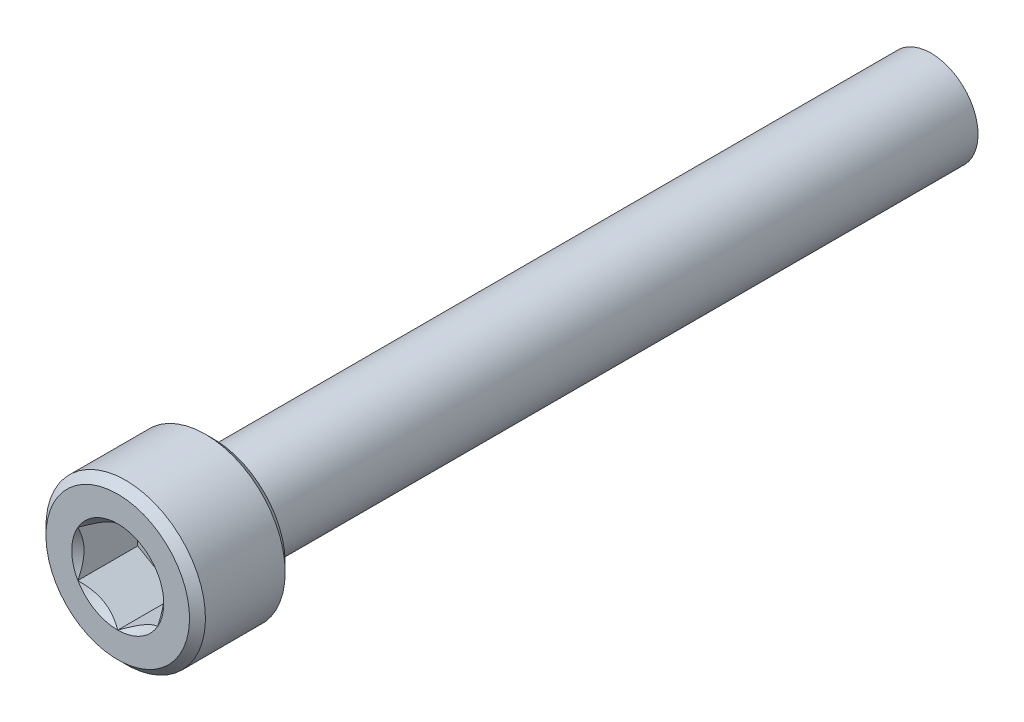
ISO-10303-21;
HEADER;
FILE_DESCRIPTION(('STEP AP214'),'2;1');
FILE_NAME('part.step','',(''),(''),'','','');
FILE_SCHEMA(('AUTOMOTIVE_DESIGN { 1 0 10303 214 1 1 1 1 }'));
ENDSEC;
DATA;
#1=APPLICATION_CONTEXT('core data for automotive mechanical design processes');
#2=APPLICATION_PROTOCOL_DEFINITION('international standard','automotive_design',2000,#1);
#3=PRODUCT_CONTEXT('',#1,'mechanical');
#4=PRODUCT('Part','Part','',(#3));
#5=PRODUCT_RELATED_PRODUCT_CATEGORY('part','',(#4));
#6=PRODUCT_DEFINITION_FORMATION('','',#4);
#7=PRODUCT_DEFINITION_CONTEXT('part definition',#1,'design');
#8=PRODUCT_DEFINITION('design','',#6,#7);
#9=PRODUCT_DEFINITION_SHAPE('','',#8);
#10=(LENGTH_UNIT() NAMED_UNIT(*) SI_UNIT(.MILLI.,.METRE.));
#11=(NAMED_UNIT(*) PLANE_ANGLE_UNIT() SI_UNIT($,.RADIAN.));
#12=(NAMED_UNIT(*) SI_UNIT($,.STERADIAN.) SOLID_ANGLE_UNIT());
#13=UNCERTAINTY_MEASURE_WITH_UNIT(LENGTH_MEASURE(1.E-05),#10,'distance_accuracy_value','');
#14=(GEOMETRIC_REPRESENTATION_CONTEXT(3) GLOBAL_UNCERTAINTY_ASSIGNED_CONTEXT((#13)) GLOBAL_UNIT_ASSIGNED_CONTEXT((#10,
#11,#12)) REPRESENTATION_CONTEXT('',''));
#15=CARTESIAN_POINT('',(0.,0.,0.));
#16=DIRECTION('',(0.,0.,1.));
#17=DIRECTION('',(1.,0.,0.));
#18=AXIS2_PLACEMENT_3D('',#15,#16,#17);
#19=CARTESIAN_POINT('',(2.5,-4.33012701892219,2.25));
#20=DIRECTION('',(0.,0.,1.));
#21=DIRECTION('',(0.,-1.,0.));
#22=AXIS2_PLACEMENT_3D('',#19,#20,#21);
#23=PLANE('',#22);
#24=DIRECTION('',(-0.866025403784439,-0.5,0.));
#25=VECTOR('',#24,1.);
#26=CARTESIAN_POINT('',(0.,2.88675134594813,2.25));
#27=LINE('',#26,#25);
#28=CARTESIAN_POINT('',(0.,2.88675134594813,2.25));
#29=VERTEX_POINT('',#28);
#30=CARTESIAN_POINT('',(-2.5,1.44337567297407,2.25));
#31=VERTEX_POINT('',#30);
#32=EDGE_CURVE('E82',#29,#31,#27,.T.);
#33=ORIENTED_EDGE('',*,*,#32,.T.);
#34=DIRECTION('',(0.,-1.,0.));
#35=VECTOR('',#34,1.);
#36=CARTESIAN_POINT('',(-2.5,1.44337567297407,2.25));
#37=LINE('',#36,#35);
#38=CARTESIAN_POINT('',(-2.5,-1.44337567297406,2.25));
#39=VERTEX_POINT('',#38);
#40=EDGE_CURVE('E84',#31,#39,#37,.T.);
#41=ORIENTED_EDGE('',*,*,#40,.T.);
#42=DIRECTION('',(0.866025403784439,-0.5,0.));
#43=VECTOR('',#42,1.);
#44=CARTESIAN_POINT('',(-2.5,-1.44337567297406,2.25));
#45=LINE('',#44,#43);
#46=CARTESIAN_POINT('',(0.,-2.88675134594813,2.25));
#47=VERTEX_POINT('',#46);
#48=EDGE_CURVE('E85',#39,#47,#45,.T.);
#49=ORIENTED_EDGE('',*,*,#48,.T.);
#50=DIRECTION('',(0.866025403784439,0.5,0.));
#51=VECTOR('',#50,1.);
#52=CARTESIAN_POINT('',(0.,-2.88675134594813,2.25));
#53=LINE('',#52,#51);
#54=CARTESIAN_POINT('',(2.5,-1.44337567297406,2.25));
#55=VERTEX_POINT('',#54);
#56=EDGE_CURVE('E71',#47,#55,#53,.T.);
#57=ORIENTED_EDGE('',*,*,#56,.T.);
#58=DIRECTION('',(0.,1.,0.));
#59=VECTOR('',#58,1.);
#60=CARTESIAN_POINT('',(2.5,-1.44337567297406,2.25));
#61=LINE('',#60,#59);
#62=CARTESIAN_POINT('',(2.5,1.44337567297407,2.25));
#63=VERTEX_POINT('',#62);
#64=EDGE_CURVE('E110',#55,#63,#61,.T.);
#65=ORIENTED_EDGE('',*,*,#64,.T.);
#66=DIRECTION('',(-0.866025403784439,0.5,0.));
#67=VECTOR('',#66,1.);
#68=CARTESIAN_POINT('',(2.5,1.44337567297407,2.25));
#69=LINE('',#68,#67);
#70=EDGE_CURVE('E115',#63,#29,#69,.T.);
#71=ORIENTED_EDGE('',*,*,#70,.T.);
#72=EDGE_LOOP('',(#33,#41,#49,#57,#65,#71));
#73=FACE_BOUND('',#72,.T.);
#74=ADVANCED_FACE('F16',(#73),#23,.T.);
#75=CARTESIAN_POINT('',(-2.5,-1.44337567297406,2.25));
#76=DIRECTION('',(-0.5,-0.866025403784439,0.));
#77=DIRECTION('',(0.866025403784439,-0.5,0.));
#78=AXIS2_PLACEMENT_3D('',#75,#76,#77);
#79=PLANE('',#78);
#80=CARTESIAN_POINT('',(-2.50000000000478,-1.44337567296488,5.99999999997284));
#81=CARTESIAN_POINT('',(-2.41407377906344,-1.49298519975992,5.95043808245741));
#82=CARTESIAN_POINT('',(-2.32671086994276,-1.54342419885962,5.90378750042485));
#83=CARTESIAN_POINT('',(-2.14856893286567,-1.64627449418629,5.8183722762495));
#84=CARTESIAN_POINT('',(-2.05777297285882,-1.69869556613711,5.77965514357985));
#85=CARTESIAN_POINT('',(-1.87468737313266,-1.80440008642343,5.71333243481046));
#86=CARTESIAN_POINT('',(-1.78244433466394,-1.85765662951433,5.68556020407587));
#87=CARTESIAN_POINT('',(-1.59592809138011,-1.96534183278258,5.64277179301007));
#88=CARTESIAN_POINT('',(-1.50166058027178,-2.01976720569677,5.62772368472119));
#89=CARTESIAN_POINT('',(-1.33918618210886,-2.11357184321254,5.61414605045882));
#90=CARTESIAN_POINT('',(-1.27118904996239,-2.15283000576143,5.61213672815934));
#91=CARTESIAN_POINT('',(-1.13530603995205,-2.2312820981692,5.61552620020698));
#92=CARTESIAN_POINT('',(-1.06742020943239,-2.27047600069389,5.620927591165));
#93=CARTESIAN_POINT('',(-0.932289663227805,-2.34849365792084,5.63883111085846));
#94=CARTESIAN_POINT('',(-0.865045749955355,-2.38731694935006,5.65134117856481));
#95=CARTESIAN_POINT('',(-0.731720772442206,-2.46429216100698,5.68277536815797));
#96=CARTESIAN_POINT('',(-0.66563961942911,-2.50244413248745,5.70169899813869));
#97=CARTESIAN_POINT('',(-0.496416901917538,-2.60014491399575,5.75786430114282));
#98=CARTESIAN_POINT('',(-0.394323538956246,-2.65908854458393,5.79933497180169));
#99=CARTESIAN_POINT('',(-0.244203096422894,-2.74576062249143,5.86934112808069));
#100=CARTESIAN_POINT('',(-0.194731548971638,-2.77432303372964,5.89393775594674));
#101=CARTESIAN_POINT('',(-0.0967044691439402,-2.83091899465603,5.94537285125215));
#102=CARTESIAN_POINT('',(-0.0481483974394195,-2.85895285572543,5.9722099447588));
#103=CARTESIAN_POINT('',(8.22878246257458E-12,-2.88675134595287,5.99999999997017));
#104=B_SPLINE_CURVE_WITH_KNOTS('',3,(#80,#81,#82,#83,#84,#85,#86,#87,#88,#89,#90,#91,#92,#93,
#94,#95,#96,#97,#98,#99,#100,#101,#102,#103),.UNSPECIFIED.,.F.,.F.,(4,2,2,2,2,2,2,2,2,2,2,4),
(0.,0.332957366453414,0.667853853669039,0.997433317041697,1.32618330926339,1.56147590696143,
1.79685096897262,2.0324894159688,2.26810979410381,2.6422318258904,2.82878537250701,
3.01522534660843),.UNSPECIFIED.);
#105=CARTESIAN_POINT('',(-2.50000000000431,-1.44337567297655,5.9999999999704));
#106=VERTEX_POINT('',#105);
#107=CARTESIAN_POINT('',(-1.2122602004148E-12,-2.8867513459538,5.9999999999711));
#108=VERTEX_POINT('',#107);
#109=EDGE_CURVE('E19',#106,#108,#104,.T.);
#110=ORIENTED_EDGE('',*,*,#109,.T.);
#111=DIRECTION('',(0.,0.,1.));
#112=VECTOR('',#111,1.);
#113=CARTESIAN_POINT('',(0.,-2.88675134594813,2.25));
#114=LINE('',#113,#112);
#115=EDGE_CURVE('E90',#108,#47,#114,.F.);
#116=ORIENTED_EDGE('',*,*,#115,.T.);
#117=ORIENTED_EDGE('',*,*,#48,.F.);
#118=DIRECTION('',(0.,0.,1.));
#119=VECTOR('',#118,1.);
#120=CARTESIAN_POINT('',(-2.5,-1.44337567297406,2.25));
#121=LINE('',#120,#119);
#122=EDGE_CURVE('E58',#39,#106,#121,.T.);
#123=ORIENTED_EDGE('',*,*,#122,.T.);
#124=EDGE_LOOP('',(#110,#116,#117,#123));
#125=FACE_BOUND('',#124,.T.);
#126=ADVANCED_FACE('F89',(#125),#79,.F.);
#127=CARTESIAN_POINT('',(-2.5,1.44337567297407,2.25));
#128=DIRECTION('',(-1.,0.,0.));
#129=DIRECTION('',(0.,-1.,0.));
#130=AXIS2_PLACEMENT_3D('',#127,#128,#129);
#131=PLANE('',#130);
#132=CARTESIAN_POINT('',(-2.49999999999444,1.4433756729828,5.99999999997284));
#133=CARTESIAN_POINT('',(-2.499999999998,1.3441566194114,5.95043808245644));
#134=CARTESIAN_POINT('',(-2.49999999999946,1.24327862122713,5.90378750042239));
#135=CARTESIAN_POINT('',(-2.50000000000054,1.03757803060085,5.81837227624268));
#136=CARTESIAN_POINT('',(-2.50000000000014,0.932735886711096,5.77965514357014));
#137=CARTESIAN_POINT('',(-2.49999999999986,0.721326846162478,5.7133324347933));
#138=CARTESIAN_POINT('',(-2.49999999999996,0.614813759992766,5.68556020405418));
#139=CARTESIAN_POINT('',(-2.50000000000004,0.399443353479625,5.64277179297774));
#140=CARTESIAN_POINT('',(-2.50000000000001,0.290592607662495,5.62772368468276));
#141=CARTESIAN_POINT('',(-2.49999999999999,0.10298333265714,5.61414605040953));
#142=CARTESIAN_POINT('',(-2.5,0.0244670075745337,5.61213672810486));
#143=CARTESIAN_POINT('',(-2.5,-0.132437177211233,5.61552620014042));
#144=CARTESIAN_POINT('',(-2.5,-0.210824982246007,5.62092759109157));
#145=CARTESIAN_POINT('',(-2.5,-0.366860296671375,5.63883111077006));
#146=CARTESIAN_POINT('',(-2.5,-0.444506879515861,5.65134117846832));
#147=CARTESIAN_POINT('',(-2.5,-0.598457302802447,5.68277536804459));
#148=CARTESIAN_POINT('',(-2.5,-0.67476124575008,5.7016989980165));
#149=CARTESIAN_POINT('',(-2.5,-0.87016280881075,5.75786430101982));
#150=CARTESIAN_POINT('',(-2.5,-0.988050070042253,5.79933497169557));
#151=CARTESIAN_POINT('',(-2.5,-1.16139422593618,5.86934112800866));
#152=CARTESIAN_POINT('',(-2.5,-1.21851904843836,5.89393775588756));
#153=CARTESIAN_POINT('',(-2.5,-1.3317109703414,5.94537285122098));
#154=CARTESIAN_POINT('',(-2.5,-1.38777869250468,5.97220994474277));
#155=CARTESIAN_POINT('',(-2.5,-1.44337567298356,5.99999999997017));
#156=B_SPLINE_CURVE_WITH_KNOTS('',3,(#132,#133,#134,#135,#136,#137,#138,#139,#140,#141,#142,
#143,#144,#145,#146,#147,#148,#149,#150,#151,#152,#153,#154,#155),.UNSPECIFIED.,.F.,.F.,(4,2,2,
2,2,2,2,2,2,2,2,4),(0.,0.332957366421071,0.667853853604345,0.997433316945952,1.32618330913662,
1.56147590678967,1.79685096875581,2.03248941570688,2.26810979379679,2.64223182575469,
2.8287853724575,3.01522534664473),.UNSPECIFIED.);
#157=CARTESIAN_POINT('',(-2.50000000000431,1.44337567297656,5.9999999999704));
#158=VERTEX_POINT('',#157);
#159=EDGE_CURVE('E94',#158,#106,#156,.T.);
#160=ORIENTED_EDGE('',*,*,#159,.T.);
#161=ORIENTED_EDGE('',*,*,#122,.F.);
#162=ORIENTED_EDGE('',*,*,#40,.F.);
#163=DIRECTION('',(0.,0.,1.));
#164=VECTOR('',#163,1.);
#165=CARTESIAN_POINT('',(-2.5,1.44337567297407,2.25));
#166=LINE('',#165,#164);
#167=EDGE_CURVE('E96',#31,#158,#166,.T.);
#168=ORIENTED_EDGE('',*,*,#167,.T.);
#169=EDGE_LOOP('',(#160,#161,#162,#168));
#170=FACE_BOUND('',#169,.T.);
#171=ADVANCED_FACE('F92',(#170),#131,.F.);
#172=CARTESIAN_POINT('',(0.,2.88675134594813,2.25));
#173=DIRECTION('',(-0.5,0.866025403784439,0.));
#174=DIRECTION('',(-0.866025403784439,-0.5,0.));
#175=AXIS2_PLACEMENT_3D('',#172,#173,#174);
#176=PLANE('',#175);
#177=CARTESIAN_POINT('',(1.03437304235675E-11,2.88675134594768,5.99999999997284));
#178=CARTESIAN_POINT('',(-0.0859262209345602,2.8371418191588,5.95043808245742));
#179=CARTESIAN_POINT('',(-0.173289130056698,2.78670282006164,5.90378750042485));
#180=CARTESIAN_POINT('',(-0.351431067134871,2.68385252473684,5.81837227624951));
#181=CARTESIAN_POINT('',(-0.442227027141324,2.63143145278532,5.77965514357985));
#182=CARTESIAN_POINT('',(-0.6253126268672,2.52572693249852,5.71333243481047));
#183=CARTESIAN_POINT('',(-0.717555665336021,2.47247038940779,5.68556020407588));
#184=CARTESIAN_POINT('',(-0.904071908619929,2.36478518613968,5.64277179301007));
#185=CARTESIAN_POINT('',(-0.998339419728224,2.31035981322544,5.6277236847212));
#186=CARTESIAN_POINT('',(-1.16081381789113,2.21655517570964,5.61414605045883));
#187=CARTESIAN_POINT('',(-1.22881095003761,2.17729701316076,5.61213672815934));
#188=CARTESIAN_POINT('',(-1.36469396004795,2.09884492075299,5.61552620020698));
#189=CARTESIAN_POINT('',(-1.43257979056761,2.0596510182283,5.620927591165));
#190=CARTESIAN_POINT('',(-1.56771033677219,1.98163336100134,5.63883111085846));
#191=CARTESIAN_POINT('',(-1.63495425004464,1.94281006957213,5.65134117856481));
#192=CARTESIAN_POINT('',(-1.76827922755779,1.86583485791521,5.68277536815798));
#193=CARTESIAN_POINT('',(-1.83436038057089,1.82768288643474,5.7016989981387));
#194=CARTESIAN_POINT('',(-2.00358309808246,1.72998210492644,5.75786430114282));
#195=CARTESIAN_POINT('',(-2.10567646104375,1.67103847433826,5.79933497180169));
#196=CARTESIAN_POINT('',(-2.2557969035771,1.58436639643077,5.8693411280807));
#197=CARTESIAN_POINT('',(-2.30526845102836,1.55580398519256,5.89393775594674));
#198=CARTESIAN_POINT('',(-2.40329553085606,1.49920802426616,5.94537285125216));
#199=CARTESIAN_POINT('',(-2.45185160256058,1.47117416319677,5.9722099447588));
#200=CARTESIAN_POINT('',(-2.50000000000822,1.44337567296932,5.99999999997017));
#201=B_SPLINE_CURVE_WITH_KNOTS('',3,(#177,#178,#179,#180,#181,#182,#183,#184,#185,#186,#187,
#188,#189,#190,#191,#192,#193,#194,#195,#196,#197,#198,#199,#200),.UNSPECIFIED.,.F.,.F.,(4,2,2,
2,2,2,2,2,2,2,2,4),(0.,0.332957366453413,0.667853853669037,0.997433317041695,1.32618330926339,
1.56147590696143,1.79685096897261,2.0324894159688,2.26810979410381,2.6422318258904,
2.828785372507,3.01522534660842),.UNSPECIFIED.);
#202=CARTESIAN_POINT('',(0.,2.88675134595311,5.9999999999704));
#203=VERTEX_POINT('',#202);
#204=EDGE_CURVE('E197',#203,#158,#201,.T.);
#205=ORIENTED_EDGE('',*,*,#204,.T.);
#206=ORIENTED_EDGE('',*,*,#167,.F.);
#207=ORIENTED_EDGE('',*,*,#32,.F.);
#208=DIRECTION('',(0.,0.,1.));
#209=VECTOR('',#208,1.);
#210=CARTESIAN_POINT('',(0.,2.88675134594813,2.25));
#211=LINE('',#210,#209);
#212=EDGE_CURVE('E112',#29,#203,#211,.T.);
#213=ORIENTED_EDGE('',*,*,#212,.T.);
#214=EDGE_LOOP('',(#205,#206,#207,#213));
#215=FACE_BOUND('',#214,.T.);
#216=ADVANCED_FACE('F207',(#215),#176,.F.);
#217=CARTESIAN_POINT('',(2.5,1.44337567297407,2.25));
#218=DIRECTION('',(0.5,0.866025403784439,0.));
#219=DIRECTION('',(-0.866025403784439,0.5,0.));
#220=AXIS2_PLACEMENT_3D('',#217,#218,#219);
#221=PLANE('',#220);
#222=CARTESIAN_POINT('',(2.50000000000478,1.44337567296489,5.99999999997284));
#223=CARTESIAN_POINT('',(2.41407377906344,1.49298519975993,5.95043808245742));
#224=CARTESIAN_POINT('',(2.32671086994276,1.54342419885963,5.90378750042486));
#225=CARTESIAN_POINT('',(2.14856893286567,1.6462744941863,5.81837227624951));
#226=CARTESIAN_POINT('',(2.05777297285882,1.69869556613712,5.77965514357985));
#227=CARTESIAN_POINT('',(1.87468737313266,1.80440008642344,5.71333243481047));
#228=CARTESIAN_POINT('',(1.78244433466394,1.85765662951434,5.68556020407588));
#229=CARTESIAN_POINT('',(1.59592809138011,1.96534183278259,5.64277179301007));
#230=CARTESIAN_POINT('',(1.50166058027179,2.01976720569678,5.6277236847212));
#231=CARTESIAN_POINT('',(1.33918618210886,2.11357184321255,5.61414605045883));
#232=CARTESIAN_POINT('',(1.2711890499624,2.15283000576144,5.61213672815935));
#233=CARTESIAN_POINT('',(1.13530603995205,2.23128209816921,5.61552620020699));
#234=CARTESIAN_POINT('',(1.06742020943239,2.2704760006939,5.62092759116501));
#235=CARTESIAN_POINT('',(0.932289663227807,2.34849365792085,5.63883111085847));
#236=CARTESIAN_POINT('',(0.865045749955358,2.38731694935007,5.65134117856482));
#237=CARTESIAN_POINT('',(0.731720772442207,2.46429216100699,5.68277536815798));
#238=CARTESIAN_POINT('',(0.665639619429111,2.50244413248746,5.7016989981387));
#239=CARTESIAN_POINT('',(0.49641690191754,2.60014491399576,5.75786430114283));
#240=CARTESIAN_POINT('',(0.394323538956249,2.65908854458394,5.7993349718017));
#241=CARTESIAN_POINT('',(0.244203096422899,2.74576062249143,5.8693411280807));
#242=CARTESIAN_POINT('',(0.194731548971643,2.77432303372964,5.89393775594674));
#243=CARTESIAN_POINT('',(0.0967044691439463,2.83091899465604,5.94537285125216));
#244=CARTESIAN_POINT('',(0.048148397439426,2.85895285572543,5.9722099447588));
#245=CARTESIAN_POINT('',(-8.22208739684531E-12,2.88675134595288,5.99999999997018));
#246=B_SPLINE_CURVE_WITH_KNOTS('',3,(#222,#223,#224,#225,#226,#227,#228,#229,#230,#231,#232,
#233,#234,#235,#236,#237,#238,#239,#240,#241,#242,#243,#244,#245),.UNSPECIFIED.,.F.,.F.,(4,2,2,
2,2,2,2,2,2,2,2,4),(0.,0.332957366453411,0.667853853669034,0.997433317041691,1.32618330926338,
1.56147590696142,1.79685096897261,2.03248941596879,2.26810979410381,2.64223182589039,
2.828785372507,3.01522534660841),.UNSPECIFIED.);
#247=CARTESIAN_POINT('',(2.50000000000431,1.44337567297656,5.9999999999704));
#248=VERTEX_POINT('',#247);
#249=EDGE_CURVE('E189',#248,#203,#246,.T.);
#250=ORIENTED_EDGE('',*,*,#249,.T.);
#251=ORIENTED_EDGE('',*,*,#212,.F.);
#252=ORIENTED_EDGE('',*,*,#70,.F.);
#253=DIRECTION('',(0.,0.,-1.));
#254=VECTOR('',#253,1.);
#255=CARTESIAN_POINT('',(2.5,1.44337567297407,2.25));
#256=LINE('',#255,#254);
#257=EDGE_CURVE('E107',#63,#248,#256,.F.);
#258=ORIENTED_EDGE('',*,*,#257,.T.);
#259=EDGE_LOOP('',(#250,#251,#252,#258));
#260=FACE_BOUND('',#259,.T.);
#261=ADVANCED_FACE('F203',(#260),#221,.F.);
#262=CARTESIAN_POINT('',(2.5,-1.44337567297406,2.25));
#263=DIRECTION('',(1.,0.,0.));
#264=DIRECTION('',(0.,0.,-1.));
#265=AXIS2_PLACEMENT_3D('',#262,#263,#264);
#266=PLANE('',#265);
#267=CARTESIAN_POINT('',(2.49999999999444,-1.44337567298279,5.99999999997284));
#268=CARTESIAN_POINT('',(2.499999999998,-1.3441566194114,5.95043808245644));
#269=CARTESIAN_POINT('',(2.49999999999946,-1.24327862122713,5.90378750042239));
#270=CARTESIAN_POINT('',(2.50000000000054,-1.03757803060085,5.81837227624268));
#271=CARTESIAN_POINT('',(2.50000000000014,-0.932735886711091,5.77965514357014));
#272=CARTESIAN_POINT('',(2.49999999999986,-0.721326846162473,5.7133324347933));
#273=CARTESIAN_POINT('',(2.49999999999996,-0.614813759992762,5.68556020405418));
#274=CARTESIAN_POINT('',(2.50000000000004,-0.399443353479622,5.64277179297774));
#275=CARTESIAN_POINT('',(2.50000000000001,-0.290592607662492,5.62772368468276));
#276=CARTESIAN_POINT('',(2.49999999999999,-0.102983332657137,5.61414605040954));
#277=CARTESIAN_POINT('',(2.5,-0.0244670075745308,5.61213672810486));
#278=CARTESIAN_POINT('',(2.5,0.132437177211236,5.61552620014043));
#279=CARTESIAN_POINT('',(2.5,0.21082498224601,5.62092759109157));
#280=CARTESIAN_POINT('',(2.5,0.366860296671379,5.63883111077006));
#281=CARTESIAN_POINT('',(2.5,0.444506879515865,5.65134117846832));
#282=CARTESIAN_POINT('',(2.5,0.598457302802451,5.68277536804459));
#283=CARTESIAN_POINT('',(2.5,0.674761245750083,5.7016989980165));
#284=CARTESIAN_POINT('',(2.5,0.870162808810754,5.75786430101983));
#285=CARTESIAN_POINT('',(2.5,0.988050070042257,5.79933497169558));
#286=CARTESIAN_POINT('',(2.5,1.16139422593619,5.86934112800866));
#287=CARTESIAN_POINT('',(2.5,1.21851904843837,5.89393775588756));
#288=CARTESIAN_POINT('',(2.5,1.33171097034141,5.94537285122098));
#289=CARTESIAN_POINT('',(2.5,1.38777869250468,5.97220994474277));
#290=CARTESIAN_POINT('',(2.5,1.44337567298357,5.99999999997018));
#291=B_SPLINE_CURVE_WITH_KNOTS('',3,(#267,#268,#269,#270,#271,#272,#273,#274,#275,#276,#277,
#278,#279,#280,#281,#282,#283,#284,#285,#286,#287,#288,#289,#290),.UNSPECIFIED.,.F.,.F.,(4,2,2,
2,2,2,2,2,2,2,2,4),(0.,0.33295736642107,0.667853853604343,0.997433316945949,1.32618330913661,
1.56147590678967,1.79685096875581,2.03248941570687,2.26810979379679,2.64223182575469,
2.8287853724575,3.01522534664473),.UNSPECIFIED.);
#292=CARTESIAN_POINT('',(2.50000000000431,-1.44337567297655,5.9999999999704));
#293=VERTEX_POINT('',#292);
#294=EDGE_CURVE('E159',#293,#248,#291,.T.);
#295=ORIENTED_EDGE('',*,*,#294,.T.);
#296=ORIENTED_EDGE('',*,*,#257,.F.);
#297=ORIENTED_EDGE('',*,*,#64,.F.);
#298=DIRECTION('',(0.,0.,1.));
#299=VECTOR('',#298,1.);
#300=CARTESIAN_POINT('',(2.5,-1.44337567297406,2.25));
#301=LINE('',#300,#299);
#302=EDGE_CURVE('E39',#55,#293,#301,.T.);
#303=ORIENTED_EDGE('',*,*,#302,.T.);
#304=EDGE_LOOP('',(#295,#296,#297,#303));
#305=FACE_BOUND('',#304,.T.);
#306=ADVANCED_FACE('F206',(#305),#266,.F.);
#307=CARTESIAN_POINT('',(0.,-2.88675134594813,2.25));
#308=DIRECTION('',(0.5,-0.866025403784439,0.));
#309=DIRECTION('',(0.866025403784439,0.5,0.));
#310=AXIS2_PLACEMENT_3D('',#307,#308,#309);
#311=PLANE('',#310);
#312=CARTESIAN_POINT('',(-1.03421625670786E-11,-2.88675134594768,5.99999999997284));
#313=CARTESIAN_POINT('',(0.0859262209345617,-2.8371418191588,5.95043808245742));
#314=CARTESIAN_POINT('',(0.1732891300567,-2.78670282006164,5.90378750042485));
#315=CARTESIAN_POINT('',(0.351431067134872,-2.68385252473684,5.81837227624951));
#316=CARTESIAN_POINT('',(0.442227027141325,-2.63143145278532,5.77965514357985));
#317=CARTESIAN_POINT('',(0.625312626867201,-2.52572693249852,5.71333243481047));
#318=CARTESIAN_POINT('',(0.717555665336022,-2.47247038940779,5.68556020407588));
#319=CARTESIAN_POINT('',(0.904071908619929,-2.36478518613968,5.64277179301007));
#320=CARTESIAN_POINT('',(0.998339419728224,-2.31035981322543,5.6277236847212));
#321=CARTESIAN_POINT('',(1.16081381789113,-2.21655517570964,5.61414605045883));
#322=CARTESIAN_POINT('',(1.2288109500376,-2.17729701316076,5.61213672815935));
#323=CARTESIAN_POINT('',(1.36469396004795,-2.09884492075299,5.61552620020698));
#324=CARTESIAN_POINT('',(1.43257979056761,-2.0596510182283,5.62092759116501));
#325=CARTESIAN_POINT('',(1.56771033677219,-1.98163336100134,5.63883111085846));
#326=CARTESIAN_POINT('',(1.63495425004464,-1.94281006957213,5.65134117856481));
#327=CARTESIAN_POINT('',(1.76827922755779,-1.86583485791521,5.68277536815798));
#328=CARTESIAN_POINT('',(1.83436038057089,-1.82768288643474,5.7016989981387));
#329=CARTESIAN_POINT('',(2.00358309808246,-1.72998210492644,5.75786430114283));
#330=CARTESIAN_POINT('',(2.10567646104375,-1.67103847433826,5.7993349718017));
#331=CARTESIAN_POINT('',(2.25579690357711,-1.58436639643076,5.8693411280807));
#332=CARTESIAN_POINT('',(2.30526845102836,-1.55580398519255,5.89393775594674));
#333=CARTESIAN_POINT('',(2.40329553085606,-1.49920802426616,5.94537285125216));
#334=CARTESIAN_POINT('',(2.45185160256058,-1.47117416319676,5.9722099447588));
#335=CARTESIAN_POINT('',(2.50000000000823,-1.44337567296932,5.99999999997018));
#336=B_SPLINE_CURVE_WITH_KNOTS('',3,(#312,#313,#314,#315,#316,#317,#318,#319,#320,#321,#322,
#323,#324,#325,#326,#327,#328,#329,#330,#331,#332,#333,#334,#335),.UNSPECIFIED.,.F.,.F.,(4,2,2,
2,2,2,2,2,2,2,2,4),(0.,0.332957366453413,0.667853853669036,0.997433317041693,1.32618330926338,
1.56147590696143,1.79685096897261,2.0324894159688,2.26810979410381,2.6422318258904,
2.828785372507,3.01522534660842),.UNSPECIFIED.);
#337=EDGE_CURVE('E151',#108,#293,#336,.T.);
#338=ORIENTED_EDGE('',*,*,#337,.T.);
#339=ORIENTED_EDGE('',*,*,#302,.F.);
#340=ORIENTED_EDGE('',*,*,#56,.F.);
#341=ORIENTED_EDGE('',*,*,#115,.F.);
#342=EDGE_LOOP('',(#338,#339,#340,#341));
#343=FACE_BOUND('',#342,.T.);
#344=ADVANCED_FACE('F167',(#343),#311,.F.);
#345=CARTESIAN_POINT('',(0.,0.,5.99999999997181));
#346=DIRECTION('',(0.,0.,1.));
#347=DIRECTION('',(0.,-1.,0.));
#348=AXIS2_PLACEMENT_3D('',#345,#346,#347);
#349=CONICAL_SURFACE('',#348,2.88675134595451,0.785398163397448);
#350=ORIENTED_EDGE('',*,*,#109,.F.);
#351=CARTESIAN_POINT('',(0.,0.,5.99999999997181));
#352=DIRECTION('',(0.,0.,1.));
#353=DIRECTION('',(0.,-1.,0.));
#354=AXIS2_PLACEMENT_3D('',#351,#352,#353);
#355=CIRCLE('',#354,2.88675134595451);
#356=EDGE_CURVE('E148',#108,#106,#355,.F.);
#357=ORIENTED_EDGE('',*,*,#356,.F.);
#358=EDGE_LOOP('',(#350,#357));
#359=FACE_BOUND('',#358,.T.);
#360=ADVANCED_FACE('F224',(#359),#349,.F.);
#361=CARTESIAN_POINT('',(0.,0.,5.99999999997181));
#362=DIRECTION('',(0.,0.,1.));
#363=DIRECTION('',(0.,-1.,0.));
#364=AXIS2_PLACEMENT_3D('',#361,#362,#363);
#365=CONICAL_SURFACE('',#364,2.88675134595451,0.785398163324398);
#366=CARTESIAN_POINT('',(0.,0.,5.99999999997181));
#367=DIRECTION('',(0.,0.,1.));
#368=DIRECTION('',(0.,-1.,0.));
#369=AXIS2_PLACEMENT_3D('',#366,#367,#368);
#370=CIRCLE('',#369,2.88675134595451);
#371=EDGE_CURVE('E145',#106,#158,#370,.F.);
#372=ORIENTED_EDGE('',*,*,#371,.F.);
#373=ORIENTED_EDGE('',*,*,#159,.F.);
#374=EDGE_LOOP('',(#372,#373));
#375=FACE_BOUND('',#374,.T.);
#376=ADVANCED_FACE('F221',(#375),#365,.F.);
#377=CARTESIAN_POINT('',(0.,0.,5.99999999997181));
#378=DIRECTION('',(0.,0.,1.));
#379=DIRECTION('',(0.,-1.,0.));
#380=AXIS2_PLACEMENT_3D('',#377,#378,#379);
#381=CONICAL_SURFACE('',#380,2.88675134595451,0.785398163397448);
#382=ORIENTED_EDGE('',*,*,#204,.F.);
#383=CARTESIAN_POINT('',(0.,0.,5.99999999997181));
#384=DIRECTION('',(0.,0.,1.));
#385=DIRECTION('',(0.,-1.,0.));
#386=AXIS2_PLACEMENT_3D('',#383,#384,#385);
#387=CIRCLE('',#386,2.88675134595451);
#388=EDGE_CURVE('E142',#158,#203,#387,.F.);
#389=ORIENTED_EDGE('',*,*,#388,.F.);
#390=EDGE_LOOP('',(#382,#389));
#391=FACE_BOUND('',#390,.T.);
#392=ADVANCED_FACE('F185',(#391),#381,.F.);
#393=CARTESIAN_POINT('',(0.,0.,5.99999999997181));
#394=DIRECTION('',(0.,0.,1.));
#395=DIRECTION('',(0.,-1.,0.));
#396=AXIS2_PLACEMENT_3D('',#393,#394,#395);
#397=CONICAL_SURFACE('',#396,2.88675134595451,0.785398163397448);
#398=ORIENTED_EDGE('',*,*,#249,.F.);
#399=CARTESIAN_POINT('',(0.,0.,5.99999999997181));
#400=DIRECTION('',(0.,0.,1.));
#401=DIRECTION('',(0.,-1.,0.));
#402=AXIS2_PLACEMENT_3D('',#399,#400,#401);
#403=CIRCLE('',#402,2.88675134595451);
#404=EDGE_CURVE('E139',#203,#248,#403,.F.);
#405=ORIENTED_EDGE('',*,*,#404,.F.);
#406=EDGE_LOOP('',(#398,#405));
#407=FACE_BOUND('',#406,.T.);
#408=ADVANCED_FACE('F180',(#407),#397,.F.);
#409=CARTESIAN_POINT('',(0.,0.,5.99999999997181));
#410=DIRECTION('',(0.,0.,1.));
#411=DIRECTION('',(0.,-1.,0.));
#412=AXIS2_PLACEMENT_3D('',#409,#410,#411);
#413=CONICAL_SURFACE('',#412,2.88675134595451,0.785398163324398);
#414=ORIENTED_EDGE('',*,*,#294,.F.);
#415=CARTESIAN_POINT('',(0.,0.,5.99999999997181));
#416=DIRECTION('',(0.,0.,1.));
#417=DIRECTION('',(0.,-1.,0.));
#418=AXIS2_PLACEMENT_3D('',#415,#416,#417);
#419=CIRCLE('',#418,2.88675134595451);
#420=EDGE_CURVE('E136',#248,#293,#419,.F.);
#421=ORIENTED_EDGE('',*,*,#420,.F.);
#422=EDGE_LOOP('',(#414,#421));
#423=FACE_BOUND('',#422,.T.);
#424=ADVANCED_FACE('F174',(#423),#413,.F.);
#425=CARTESIAN_POINT('',(0.,0.,5.99999999997181));
#426=DIRECTION('',(0.,0.,1.));
#427=DIRECTION('',(0.,-1.,0.));
#428=AXIS2_PLACEMENT_3D('',#425,#426,#427);
#429=CONICAL_SURFACE('',#428,2.88675134595451,0.785398163397448);
#430=ORIENTED_EDGE('',*,*,#337,.F.);
#431=CARTESIAN_POINT('',(0.,0.,5.99999999997181));
#432=DIRECTION('',(0.,0.,1.));
#433=DIRECTION('',(0.,-1.,0.));
#434=AXIS2_PLACEMENT_3D('',#431,#432,#433);
#435=CIRCLE('',#434,2.88675134595451);
#436=EDGE_CURVE('E133',#293,#108,#435,.F.);
#437=ORIENTED_EDGE('',*,*,#436,.F.);
#438=EDGE_LOOP('',(#430,#437));
#439=FACE_BOUND('',#438,.T.);
#440=ADVANCED_FACE('F169',(#439),#429,.F.);
#441=CARTESIAN_POINT('',(0.,0.,6.));
#442=DIRECTION('',(0.,0.,1.));
#443=DIRECTION('',(0.,-1.,0.));
#444=AXIS2_PLACEMENT_3D('',#441,#442,#443);
#445=PLANE('',#444);
#446=ORIENTED_EDGE('',*,*,#420,.T.);
#447=ORIENTED_EDGE('',*,*,#436,.T.);
#448=ORIENTED_EDGE('',*,*,#356,.T.);
#449=ORIENTED_EDGE('',*,*,#371,.T.);
#450=ORIENTED_EDGE('',*,*,#388,.T.);
#451=ORIENTED_EDGE('',*,*,#404,.T.);
#452=EDGE_LOOP('',(#446,#447,#448,#449,#450,#451));
#453=FACE_BOUND('',#452,.T.);
#454=CARTESIAN_POINT('',(0.,0.,5.99999999997181));
#455=DIRECTION('',(0.,0.,-1.));
#456=DIRECTION('',(0.,1.,0.));
#457=AXIS2_PLACEMENT_3D('',#454,#455,#456);
#458=CIRCLE('',#457,4.50000000000728);
#459=CARTESIAN_POINT('',(0.,4.50000000000728,5.99999999997181));
#460=VERTEX_POINT('',#459);
#461=EDGE_CURVE('E129',#460,#460,#458,.T.);
#462=ORIENTED_EDGE('',*,*,#461,.F.);
#463=EDGE_LOOP('',(#462));
#464=FACE_BOUND('',#463,.T.);
#465=ADVANCED_FACE('F173',(#453,#464),#445,.T.);
#466=CARTESIAN_POINT('',(0.,0.,5.50000000004047));
#467=DIRECTION('',(0.,0.,-1.));
#468=DIRECTION('',(0.,1.,0.));
#469=AXIS2_PLACEMENT_3D('',#466,#467,#468);
#470=CONICAL_SURFACE('',#469,4.99999999993861,0.785398163397448);
#471=ORIENTED_EDGE('',*,*,#461,.T.);
#472=EDGE_LOOP('',(#471));
#473=FACE_BOUND('',#472,.T.);
#474=CARTESIAN_POINT('',(0.,0.,5.5));
#475=DIRECTION('',(0.,0.,-1.));
#476=DIRECTION('',(0.,1.,0.));
#477=AXIS2_PLACEMENT_3D('',#474,#475,#476);
#478=CIRCLE('',#477,5.);
#479=CARTESIAN_POINT('',(0.,5.,5.5));
#480=VERTEX_POINT('',#479);
#481=EDGE_CURVE('E132',#480,#480,#478,.T.);
#482=ORIENTED_EDGE('',*,*,#481,.F.);
#483=EDGE_LOOP('',(#482));
#484=FACE_BOUND('',#483,.T.);
#485=ADVANCED_FACE('F256',(#473,#484),#470,.T.);
#486=CARTESIAN_POINT('',(0.,0.,6.));
#487=DIRECTION('',(0.,0.,-1.));
#488=DIRECTION('',(0.,1.,0.));
#489=AXIS2_PLACEMENT_3D('',#486,#487,#488);
#490=CYLINDRICAL_SURFACE('',#489,5.);
#491=ORIENTED_EDGE('',*,*,#481,.T.);
#492=EDGE_LOOP('',(#491));
#493=FACE_BOUND('',#492,.T.);
#494=CARTESIAN_POINT('',(0.,0.,0.499999999988177));
#495=DIRECTION('',(0.,0.,1.));
#496=DIRECTION('',(-1.,0.,0.));
#497=AXIS2_PLACEMENT_3D('',#494,#495,#496);
#498=CIRCLE('',#497,4.99999999999545);
#499=CARTESIAN_POINT('',(-4.99999999999545,0.,0.499999999988177));
#500=VERTEX_POINT('',#499);
#501=EDGE_CURVE('E128',#500,#500,#498,.F.);
#502=ORIENTED_EDGE('',*,*,#501,.F.);
#503=EDGE_LOOP('',(#502));
#504=FACE_BOUND('',#503,.T.);
#505=ADVANCED_FACE('F253',(#493,#504),#490,.T.);
#506=CARTESIAN_POINT('',(0.,0.,0.49999999987449));
#507=DIRECTION('',(0.,0.,1.));
#508=DIRECTION('',(0.,-1.,0.));
#509=AXIS2_PLACEMENT_3D('',#506,#507,#508);
#510=CONICAL_SURFACE('',#509,4.99999999988177,0.785398163397448);
#511=CARTESIAN_POINT('',(0.,0.,0.));
#512=DIRECTION('',(0.,0.,1.));
#513=DIRECTION('',(0.,-1.,0.));
#514=AXIS2_PLACEMENT_3D('',#511,#512,#513);
#515=CIRCLE('',#514,4.50000000000728);
#516=CARTESIAN_POINT('',(0.,-4.50000000000728,0.));
#517=VERTEX_POINT('',#516);
#518=EDGE_CURVE('E125',#517,#517,#515,.T.);
#519=ORIENTED_EDGE('',*,*,#518,.T.);
#520=EDGE_LOOP('',(#519));
#521=FACE_BOUND('',#520,.T.);
#522=ORIENTED_EDGE('',*,*,#501,.T.);
#523=EDGE_LOOP('',(#522));
#524=FACE_BOUND('',#523,.T.);
#525=ADVANCED_FACE('F249',(#521,#524),#510,.T.);
#526=CARTESIAN_POINT('',(0.,0.,-45.));
#527=DIRECTION('',(0.,0.,-1.));
#528=DIRECTION('',(0.,1.,0.));
#529=AXIS2_PLACEMENT_3D('',#526,#527,#528);
#530=PLANE('',#529);
#531=CARTESIAN_POINT('',(0.,0.,-45.));
#532=DIRECTION('',(0.,0.,-1.));
#533=DIRECTION('',(0.,1.,0.));
#534=AXIS2_PLACEMENT_3D('',#531,#532,#533);
#535=CIRCLE('',#534,2.942);
#536=CARTESIAN_POINT('',(0.,2.94199999999999,-45.));
#537=VERTEX_POINT('',#536);
#538=EDGE_CURVE('E30',#537,#537,#535,.F.);
#539=ORIENTED_EDGE('',*,*,#538,.F.);
#540=EDGE_LOOP('',(#539));
#541=FACE_BOUND('',#540,.T.);
#542=ADVANCED_FACE('F242',(#541),#530,.T.);
#543=CARTESIAN_POINT('',(0.,0.,0.));
#544=DIRECTION('',(0.,0.,1.));
#545=DIRECTION('',(0.,-1.,0.));
#546=AXIS2_PLACEMENT_3D('',#543,#544,#545);
#547=PLANE('',#546);
#548=CARTESIAN_POINT('',(0.,0.,0.));
#549=DIRECTION('',(0.,0.,-1.));
#550=DIRECTION('',(0.,1.,0.));
#551=AXIS2_PLACEMENT_3D('',#548,#549,#550);
#552=CIRCLE('',#551,2.942);
#553=CARTESIAN_POINT('',(0.,2.942,0.));
#554=VERTEX_POINT('',#553);
#555=EDGE_CURVE('E11',#554,#554,#552,.T.);
#556=ORIENTED_EDGE('',*,*,#555,.F.);
#557=EDGE_LOOP('',(#556));
#558=FACE_BOUND('',#557,.T.);
#559=ORIENTED_EDGE('',*,*,#518,.F.);
#560=EDGE_LOOP('',(#559));
#561=FACE_BOUND('',#560,.T.);
#562=ADVANCED_FACE('F236',(#558,#561),#547,.F.);
#563=CARTESIAN_POINT('',(0.,0.,-30.));
#564=DIRECTION('',(0.,0.,-1.));
#565=DIRECTION('',(0.,1.,0.));
#566=AXIS2_PLACEMENT_3D('',#563,#564,#565);
#567=CYLINDRICAL_SURFACE('',#566,2.942);
#568=ORIENTED_EDGE('',*,*,#555,.T.);
#569=EDGE_LOOP('',(#568));
#570=FACE_BOUND('',#569,.T.);
#571=ORIENTED_EDGE('',*,*,#538,.T.);
#572=EDGE_LOOP('',(#571));
#573=FACE_BOUND('',#572,.T.);
#574=ADVANCED_FACE('F234',(#570,#573),#567,.T.);
#575=CLOSED_SHELL('',(#74,#126,#171,#216,#261,#306,#344,#360,#376,#392,#408,#424,#440,#465,#485,
#505,#525,#542,#562,#574));
#576=MANIFOLD_SOLID_BREP('B1',#575);
#577=ADVANCED_BREP_SHAPE_REPRESENTATION('',(#18,#576),#14);
#578=SHAPE_DEFINITION_REPRESENTATION(#9,#577);
ENDSEC;
END-ISO-10303-21;
